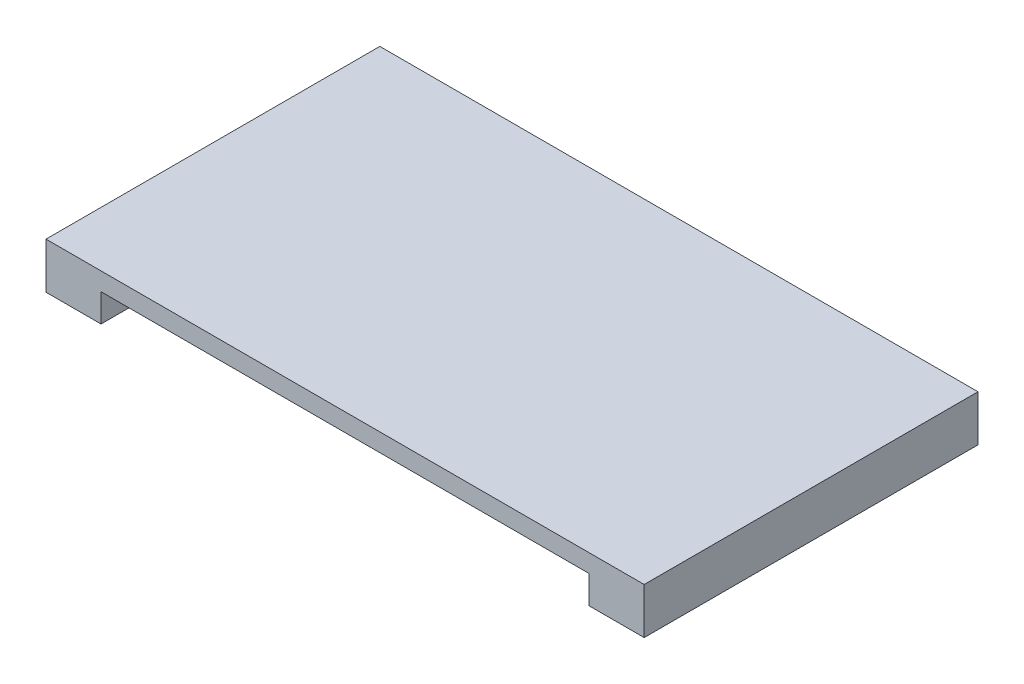
ISO-10303-21;
HEADER;
FILE_DESCRIPTION(('STEP AP214'),'2;1');
FILE_NAME('part.step','',(''),(''),'','','');
FILE_SCHEMA(('AUTOMOTIVE_DESIGN { 1 0 10303 214 1 1 1 1 }'));
ENDSEC;
DATA;
#1=APPLICATION_CONTEXT('core data for automotive mechanical design processes');
#2=APPLICATION_PROTOCOL_DEFINITION('international standard','automotive_design',2000,#1);
#3=PRODUCT_CONTEXT('',#1,'mechanical');
#4=PRODUCT('Part','Part','',(#3));
#5=PRODUCT_RELATED_PRODUCT_CATEGORY('part','',(#4));
#6=PRODUCT_DEFINITION_FORMATION('','',#4);
#7=PRODUCT_DEFINITION_CONTEXT('part definition',#1,'design');
#8=PRODUCT_DEFINITION('design','',#6,#7);
#9=PRODUCT_DEFINITION_SHAPE('','',#8);
#10=(LENGTH_UNIT() NAMED_UNIT(*) SI_UNIT(.MILLI.,.METRE.));
#11=(NAMED_UNIT(*) PLANE_ANGLE_UNIT() SI_UNIT($,.RADIAN.));
#12=(NAMED_UNIT(*) SI_UNIT($,.STERADIAN.) SOLID_ANGLE_UNIT());
#13=UNCERTAINTY_MEASURE_WITH_UNIT(LENGTH_MEASURE(1.E-05),#10,'distance_accuracy_value','');
#14=(GEOMETRIC_REPRESENTATION_CONTEXT(3) GLOBAL_UNCERTAINTY_ASSIGNED_CONTEXT((#13)) GLOBAL_UNIT_ASSIGNED_CONTEXT((#10,
#11,#12)) REPRESENTATION_CONTEXT('',''));
#15=CARTESIAN_POINT('',(0.,0.,0.));
#16=DIRECTION('',(0.,0.,1.));
#17=DIRECTION('',(1.,0.,0.));
#18=AXIS2_PLACEMENT_3D('',#15,#16,#17);
#19=CARTESIAN_POINT('',(0.,0.,0.));
#20=DIRECTION('',(0.,-1.,0.));
#21=DIRECTION('',(0.,0.,-1.));
#22=AXIS2_PLACEMENT_3D('',#19,#20,#21);
#23=PLANE('',#22);
#24=DIRECTION('',(0.,0.,-1.));
#25=VECTOR('',#24,1.);
#26=CARTESIAN_POINT('',(-13.525,0.,9.25));
#27=LINE('',#26,#25);
#28=CARTESIAN_POINT('',(-13.525,0.,9.25));
#29=VERTEX_POINT('',#28);
#30=CARTESIAN_POINT('',(-13.525,0.,-9.25));
#31=VERTEX_POINT('',#30);
#32=EDGE_CURVE('E113',#29,#31,#27,.T.);
#33=ORIENTED_EDGE('',*,*,#32,.F.);
#34=DIRECTION('',(1.,0.,0.));
#35=VECTOR('',#34,1.);
#36=CARTESIAN_POINT('',(-16.575,0.,9.25));
#37=LINE('',#36,#35);
#38=CARTESIAN_POINT('',(-16.575,0.,9.25));
#39=VERTEX_POINT('',#38);
#40=EDGE_CURVE('E144',#39,#29,#37,.T.);
#41=ORIENTED_EDGE('',*,*,#40,.F.);
#42=DIRECTION('',(0.,0.,1.));
#43=VECTOR('',#42,1.);
#44=CARTESIAN_POINT('',(-16.575,0.,9.25));
#45=LINE('',#44,#43);
#46=CARTESIAN_POINT('',(-16.575,0.,-9.25));
#47=VERTEX_POINT('',#46);
#48=EDGE_CURVE('E155',#47,#39,#45,.T.);
#49=ORIENTED_EDGE('',*,*,#48,.F.);
#50=DIRECTION('',(-1.,0.,0.));
#51=VECTOR('',#50,1.);
#52=CARTESIAN_POINT('',(-16.575,0.,-9.25));
#53=LINE('',#52,#51);
#54=EDGE_CURVE('E152',#31,#47,#53,.T.);
#55=ORIENTED_EDGE('',*,*,#54,.F.);
#56=EDGE_LOOP('',(#33,#41,#49,#55));
#57=FACE_BOUND('',#56,.T.);
#58=ADVANCED_FACE('F34',(#57),#23,.T.);
#59=CARTESIAN_POINT('',(16.575,2.55,9.25));
#60=DIRECTION('',(-1.,0.,0.));
#61=DIRECTION('',(0.,0.,1.));
#62=AXIS2_PLACEMENT_3D('',#59,#60,#61);
#63=PLANE('',#62);
#64=DIRECTION('',(0.,0.,-1.));
#65=VECTOR('',#64,1.);
#66=CARTESIAN_POINT('',(16.575,0.,9.25));
#67=LINE('',#66,#65);
#68=CARTESIAN_POINT('',(16.575,0.,9.25));
#69=VERTEX_POINT('',#68);
#70=CARTESIAN_POINT('',(16.575,0.,-9.25));
#71=VERTEX_POINT('',#70);
#72=EDGE_CURVE('E138',#69,#71,#67,.T.);
#73=ORIENTED_EDGE('',*,*,#72,.T.);
#74=DIRECTION('',(0.,-1.,0.));
#75=VECTOR('',#74,1.);
#76=CARTESIAN_POINT('',(16.575,2.55,-9.25));
#77=LINE('',#76,#75);
#78=CARTESIAN_POINT('',(16.575,2.55,-9.25));
#79=VERTEX_POINT('',#78);
#80=EDGE_CURVE('E11',#79,#71,#77,.T.);
#81=ORIENTED_EDGE('',*,*,#80,.F.);
#82=DIRECTION('',(0.,0.,-1.));
#83=VECTOR('',#82,1.);
#84=CARTESIAN_POINT('',(16.575,2.55,9.25));
#85=LINE('',#84,#83);
#86=CARTESIAN_POINT('',(16.575,2.55,9.25));
#87=VERTEX_POINT('',#86);
#88=EDGE_CURVE('E142',#87,#79,#85,.T.);
#89=ORIENTED_EDGE('',*,*,#88,.F.);
#90=DIRECTION('',(0.,-1.,0.));
#91=VECTOR('',#90,1.);
#92=CARTESIAN_POINT('',(16.575,2.55,9.25));
#93=LINE('',#92,#91);
#94=EDGE_CURVE('E149',#87,#69,#93,.T.);
#95=ORIENTED_EDGE('',*,*,#94,.T.);
#96=EDGE_LOOP('',(#73,#81,#89,#95));
#97=FACE_BOUND('',#96,.T.);
#98=ADVANCED_FACE('F36',(#97),#63,.F.);
#99=CARTESIAN_POINT('',(-16.575,2.55,-9.25));
#100=DIRECTION('',(0.,0.,1.));
#101=DIRECTION('',(1.,0.,0.));
#102=AXIS2_PLACEMENT_3D('',#99,#100,#101);
#103=PLANE('',#102);
#104=DIRECTION('',(1.,0.,0.));
#105=VECTOR('',#104,1.);
#106=CARTESIAN_POINT('',(-13.525,1.55,-9.25));
#107=LINE('',#106,#105);
#108=CARTESIAN_POINT('',(-13.525,1.55,-9.25));
#109=VERTEX_POINT('',#108);
#110=CARTESIAN_POINT('',(13.525,1.55,-9.25));
#111=VERTEX_POINT('',#110);
#112=EDGE_CURVE('E122',#109,#111,#107,.T.);
#113=ORIENTED_EDGE('',*,*,#112,.F.);
#114=DIRECTION('',(0.,-1.,0.));
#115=VECTOR('',#114,1.);
#116=CARTESIAN_POINT('',(-13.525,1.55,-9.25));
#117=LINE('',#116,#115);
#118=EDGE_CURVE('E107',#109,#31,#117,.T.);
#119=ORIENTED_EDGE('',*,*,#118,.T.);
#120=ORIENTED_EDGE('',*,*,#54,.T.);
#121=DIRECTION('',(0.,-1.,0.));
#122=VECTOR('',#121,1.);
#123=CARTESIAN_POINT('',(-16.575,2.55,-9.25));
#124=LINE('',#123,#122);
#125=CARTESIAN_POINT('',(-16.575,2.55,-9.25));
#126=VERTEX_POINT('',#125);
#127=EDGE_CURVE('E42',#126,#47,#124,.T.);
#128=ORIENTED_EDGE('',*,*,#127,.F.);
#129=DIRECTION('',(-1.,0.,0.));
#130=VECTOR('',#129,1.);
#131=CARTESIAN_POINT('',(-16.575,2.55,-9.25));
#132=LINE('',#131,#130);
#133=EDGE_CURVE('E86',#79,#126,#132,.T.);
#134=ORIENTED_EDGE('',*,*,#133,.F.);
#135=ORIENTED_EDGE('',*,*,#80,.T.);
#136=CARTESIAN_POINT('',(13.525,0.,-9.25));
#137=VERTEX_POINT('',#136);
#138=EDGE_CURVE('E153',#71,#137,#53,.T.);
#139=ORIENTED_EDGE('',*,*,#138,.T.);
#140=DIRECTION('',(0.,-1.,0.));
#141=VECTOR('',#140,1.);
#142=CARTESIAN_POINT('',(13.525,1.55,-9.25));
#143=LINE('',#142,#141);
#144=EDGE_CURVE('E49',#111,#137,#143,.T.);
#145=ORIENTED_EDGE('',*,*,#144,.F.);
#146=EDGE_LOOP('',(#113,#119,#120,#128,#134,#135,#139,#145));
#147=FACE_BOUND('',#146,.T.);
#148=ADVANCED_FACE('F127',(#147),#103,.F.);
#149=CARTESIAN_POINT('',(-16.575,2.55,9.25));
#150=DIRECTION('',(1.,0.,0.));
#151=DIRECTION('',(0.,0.,-1.));
#152=AXIS2_PLACEMENT_3D('',#149,#150,#151);
#153=PLANE('',#152);
#154=ORIENTED_EDGE('',*,*,#48,.T.);
#155=DIRECTION('',(0.,-1.,0.));
#156=VECTOR('',#155,1.);
#157=CARTESIAN_POINT('',(-16.575,2.55,9.25));
#158=LINE('',#157,#156);
#159=CARTESIAN_POINT('',(-16.575,2.55,9.25));
#160=VERTEX_POINT('',#159);
#161=EDGE_CURVE('E160',#160,#39,#158,.T.);
#162=ORIENTED_EDGE('',*,*,#161,.F.);
#163=DIRECTION('',(0.,0.,1.));
#164=VECTOR('',#163,1.);
#165=CARTESIAN_POINT('',(-16.575,2.55,9.25));
#166=LINE('',#165,#164);
#167=EDGE_CURVE('E146',#126,#160,#166,.T.);
#168=ORIENTED_EDGE('',*,*,#167,.F.);
#169=ORIENTED_EDGE('',*,*,#127,.T.);
#170=EDGE_LOOP('',(#154,#162,#168,#169));
#171=FACE_BOUND('',#170,.T.);
#172=ADVANCED_FACE('F166',(#171),#153,.F.);
#173=CARTESIAN_POINT('',(-16.575,2.55,9.25));
#174=DIRECTION('',(0.,0.,-1.));
#175=DIRECTION('',(-1.,0.,0.));
#176=AXIS2_PLACEMENT_3D('',#173,#174,#175);
#177=PLANE('',#176);
#178=ORIENTED_EDGE('',*,*,#40,.T.);
#179=DIRECTION('',(0.,-1.,0.));
#180=VECTOR('',#179,1.);
#181=CARTESIAN_POINT('',(-13.525,1.55,9.25));
#182=LINE('',#181,#180);
#183=CARTESIAN_POINT('',(-13.525,1.55,9.25));
#184=VERTEX_POINT('',#183);
#185=EDGE_CURVE('E136',#184,#29,#182,.T.);
#186=ORIENTED_EDGE('',*,*,#185,.F.);
#187=DIRECTION('',(-1.,0.,0.));
#188=VECTOR('',#187,1.);
#189=CARTESIAN_POINT('',(-13.525,1.55,9.25));
#190=LINE('',#189,#188);
#191=CARTESIAN_POINT('',(13.525,1.55,9.25));
#192=VERTEX_POINT('',#191);
#193=EDGE_CURVE('E116',#192,#184,#190,.T.);
#194=ORIENTED_EDGE('',*,*,#193,.F.);
#195=DIRECTION('',(0.,-1.,0.));
#196=VECTOR('',#195,1.);
#197=CARTESIAN_POINT('',(13.525,1.55,9.25));
#198=LINE('',#197,#196);
#199=CARTESIAN_POINT('',(13.525,0.,9.25));
#200=VERTEX_POINT('',#199);
#201=EDGE_CURVE('E139',#192,#200,#198,.T.);
#202=ORIENTED_EDGE('',*,*,#201,.T.);
#203=EDGE_CURVE('E79',#200,#69,#37,.T.);
#204=ORIENTED_EDGE('',*,*,#203,.T.);
#205=ORIENTED_EDGE('',*,*,#94,.F.);
#206=DIRECTION('',(1.,0.,0.));
#207=VECTOR('',#206,1.);
#208=CARTESIAN_POINT('',(-16.575,2.55,9.25));
#209=LINE('',#208,#207);
#210=EDGE_CURVE('E58',#160,#87,#209,.T.);
#211=ORIENTED_EDGE('',*,*,#210,.F.);
#212=ORIENTED_EDGE('',*,*,#161,.T.);
#213=EDGE_LOOP('',(#178,#186,#194,#202,#204,#205,#211,#212));
#214=FACE_BOUND('',#213,.T.);
#215=ADVANCED_FACE('F170',(#214),#177,.F.);
#216=CARTESIAN_POINT('',(0.,2.55,0.));
#217=DIRECTION('',(0.,-1.,0.));
#218=DIRECTION('',(0.,0.,-1.));
#219=AXIS2_PLACEMENT_3D('',#216,#217,#218);
#220=PLANE('',#219);
#221=ORIENTED_EDGE('',*,*,#88,.T.);
#222=ORIENTED_EDGE('',*,*,#133,.T.);
#223=ORIENTED_EDGE('',*,*,#167,.T.);
#224=ORIENTED_EDGE('',*,*,#210,.T.);
#225=EDGE_LOOP('',(#221,#222,#223,#224));
#226=FACE_BOUND('',#225,.T.);
#227=ADVANCED_FACE('F175',(#226),#220,.F.);
#228=DIRECTION('',(0.,0.,1.));
#229=VECTOR('',#228,1.);
#230=CARTESIAN_POINT('',(13.525,0.,9.25));
#231=LINE('',#230,#229);
#232=EDGE_CURVE('E125',#137,#200,#231,.T.);
#233=ORIENTED_EDGE('',*,*,#232,.F.);
#234=ORIENTED_EDGE('',*,*,#138,.F.);
#235=ORIENTED_EDGE('',*,*,#72,.F.);
#236=ORIENTED_EDGE('',*,*,#203,.F.);
#237=EDGE_LOOP('',(#233,#234,#235,#236));
#238=FACE_BOUND('',#237,.T.);
#239=ADVANCED_FACE('F177',(#238),#23,.T.);
#240=CARTESIAN_POINT('',(-13.525,1.55,9.25));
#241=DIRECTION('',(-1.,0.,0.));
#242=DIRECTION('',(0.,0.,1.));
#243=AXIS2_PLACEMENT_3D('',#240,#241,#242);
#244=PLANE('',#243);
#245=ORIENTED_EDGE('',*,*,#32,.T.);
#246=ORIENTED_EDGE('',*,*,#118,.F.);
#247=DIRECTION('',(0.,0.,-1.));
#248=VECTOR('',#247,1.);
#249=CARTESIAN_POINT('',(-13.525,1.55,9.25));
#250=LINE('',#249,#248);
#251=EDGE_CURVE('E110',#184,#109,#250,.T.);
#252=ORIENTED_EDGE('',*,*,#251,.F.);
#253=ORIENTED_EDGE('',*,*,#185,.T.);
#254=EDGE_LOOP('',(#245,#246,#252,#253));
#255=FACE_BOUND('',#254,.T.);
#256=ADVANCED_FACE('F109',(#255),#244,.F.);
#257=CARTESIAN_POINT('',(13.525,1.55,9.25));
#258=DIRECTION('',(1.,0.,0.));
#259=DIRECTION('',(0.,0.,-1.));
#260=AXIS2_PLACEMENT_3D('',#257,#258,#259);
#261=PLANE('',#260);
#262=ORIENTED_EDGE('',*,*,#232,.T.);
#263=ORIENTED_EDGE('',*,*,#201,.F.);
#264=DIRECTION('',(0.,0.,1.));
#265=VECTOR('',#264,1.);
#266=CARTESIAN_POINT('',(13.525,1.55,9.25));
#267=LINE('',#266,#265);
#268=EDGE_CURVE('E129',#111,#192,#267,.T.);
#269=ORIENTED_EDGE('',*,*,#268,.F.);
#270=ORIENTED_EDGE('',*,*,#144,.T.);
#271=EDGE_LOOP('',(#262,#263,#269,#270));
#272=FACE_BOUND('',#271,.T.);
#273=ADVANCED_FACE('F223',(#272),#261,.F.);
#274=CARTESIAN_POINT('',(0.,1.55,0.));
#275=DIRECTION('',(0.,-1.,0.));
#276=DIRECTION('',(0.,0.,-1.));
#277=AXIS2_PLACEMENT_3D('',#274,#275,#276);
#278=PLANE('',#277);
#279=ORIENTED_EDGE('',*,*,#251,.T.);
#280=ORIENTED_EDGE('',*,*,#112,.T.);
#281=ORIENTED_EDGE('',*,*,#268,.T.);
#282=ORIENTED_EDGE('',*,*,#193,.T.);
#283=EDGE_LOOP('',(#279,#280,#281,#282));
#284=FACE_BOUND('',#283,.T.);
#285=ADVANCED_FACE('F120',(#284),#278,.T.);
#286=CLOSED_SHELL('',(#58,#98,#148,#172,#215,#227,#239,#256,#273,#285));
#287=MANIFOLD_SOLID_BREP('B2',#286);
#288=ADVANCED_BREP_SHAPE_REPRESENTATION('',(#18,#287),#14);
#289=SHAPE_DEFINITION_REPRESENTATION(#9,#288);
ENDSEC;
END-ISO-10303-21;
